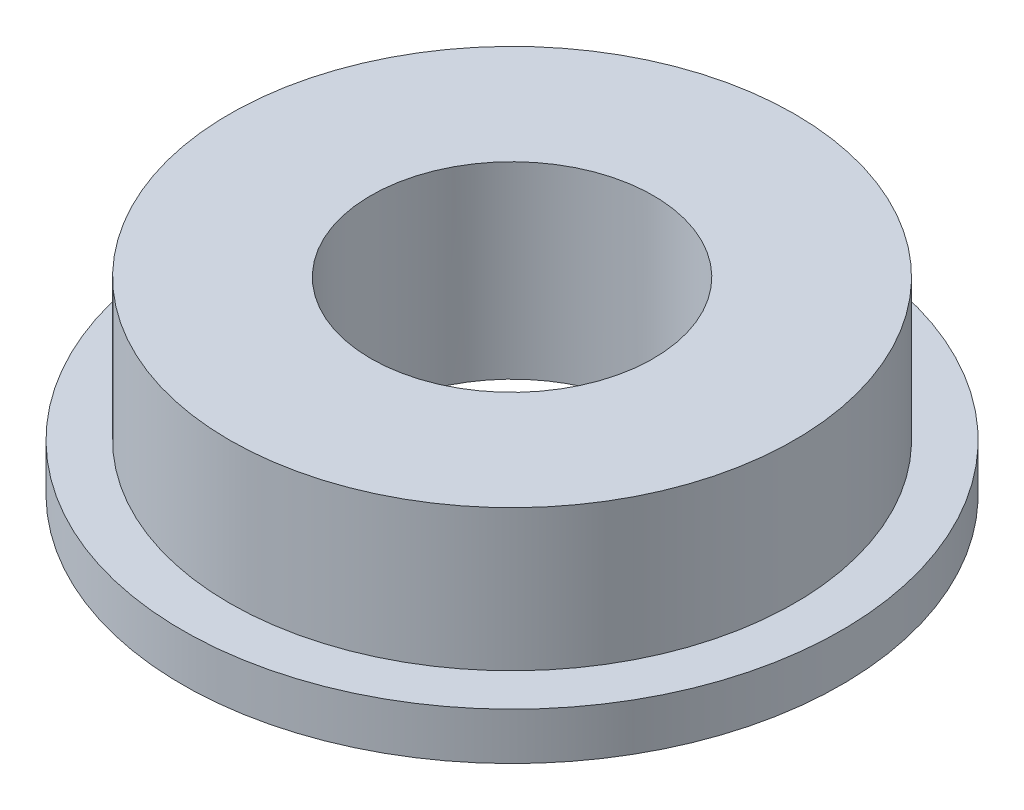
ISO-10303-21;
HEADER;
FILE_DESCRIPTION(('STEP AP214'),'2;1');
FILE_NAME('part.step','',(''),(''),'','','');
FILE_SCHEMA(('AUTOMOTIVE_DESIGN { 1 0 10303 214 1 1 1 1 }'));
ENDSEC;
DATA;
#1=APPLICATION_CONTEXT('core data for automotive mechanical design processes');
#2=APPLICATION_PROTOCOL_DEFINITION('international standard','automotive_design',2000,#1);
#3=PRODUCT_CONTEXT('',#1,'mechanical');
#4=PRODUCT('Part','Part','',(#3));
#5=PRODUCT_RELATED_PRODUCT_CATEGORY('part','',(#4));
#6=PRODUCT_DEFINITION_FORMATION('','',#4);
#7=PRODUCT_DEFINITION_CONTEXT('part definition',#1,'design');
#8=PRODUCT_DEFINITION('design','',#6,#7);
#9=PRODUCT_DEFINITION_SHAPE('','',#8);
#10=(LENGTH_UNIT() NAMED_UNIT(*) SI_UNIT(.MILLI.,.METRE.));
#11=(NAMED_UNIT(*) PLANE_ANGLE_UNIT() SI_UNIT($,.RADIAN.));
#12=(NAMED_UNIT(*) SI_UNIT($,.STERADIAN.) SOLID_ANGLE_UNIT());
#13=UNCERTAINTY_MEASURE_WITH_UNIT(LENGTH_MEASURE(1.E-05),#10,'distance_accuracy_value','');
#14=(GEOMETRIC_REPRESENTATION_CONTEXT(3) GLOBAL_UNCERTAINTY_ASSIGNED_CONTEXT((#13)) GLOBAL_UNIT_ASSIGNED_CONTEXT((#10,
#11,#12)) REPRESENTATION_CONTEXT('',''));
#15=CARTESIAN_POINT('',(0.,0.,0.));
#16=DIRECTION('',(0.,0.,1.));
#17=DIRECTION('',(1.,0.,0.));
#18=AXIS2_PLACEMENT_3D('',#15,#16,#17);
#19=CARTESIAN_POINT('',(0.,0.,0.));
#20=DIRECTION('',(0.,1.,0.));
#21=DIRECTION('',(0.,0.,1.));
#22=AXIS2_PLACEMENT_3D('',#19,#20,#21);
#23=PLANE('',#22);
#24=CARTESIAN_POINT('',(0.,0.,0.));
#25=DIRECTION('',(0.,1.,0.));
#26=DIRECTION('',(0.,0.,1.));
#27=AXIS2_PLACEMENT_3D('',#24,#25,#26);
#28=CIRCLE('',#27,3.);
#29=CARTESIAN_POINT('',(0.,0.,3.));
#30=VERTEX_POINT('',#29);
#31=EDGE_CURVE('E64',#30,#30,#28,.T.);
#32=ORIENTED_EDGE('',*,*,#31,.F.);
#33=EDGE_LOOP('',(#32));
#34=FACE_BOUND('',#33,.T.);
#35=CARTESIAN_POINT('',(0.,0.,0.));
#36=DIRECTION('',(0.,-1.,0.));
#37=DIRECTION('',(0.,0.,-1.));
#38=AXIS2_PLACEMENT_3D('',#35,#36,#37);
#39=CIRCLE('',#38,6.);
#40=CARTESIAN_POINT('',(0.,0.,-6.));
#41=VERTEX_POINT('',#40);
#42=EDGE_CURVE('E10',#41,#41,#39,.T.);
#43=ORIENTED_EDGE('',*,*,#42,.F.);
#44=EDGE_LOOP('',(#43));
#45=FACE_BOUND('',#44,.T.);
#46=ADVANCED_FACE('F37',(#34,#45),#23,.T.);
#47=CARTESIAN_POINT('',(0.,-4.,0.));
#48=DIRECTION('',(0.,-1.,0.));
#49=DIRECTION('',(0.,0.,-1.));
#50=AXIS2_PLACEMENT_3D('',#47,#48,#49);
#51=CYLINDRICAL_SURFACE('',#50,6.);
#52=ORIENTED_EDGE('',*,*,#42,.T.);
#53=EDGE_LOOP('',(#52));
#54=FACE_BOUND('',#53,.T.);
#55=CARTESIAN_POINT('',(0.,-3.,0.));
#56=DIRECTION('',(0.,-1.,0.));
#57=DIRECTION('',(0.,0.,-1.));
#58=AXIS2_PLACEMENT_3D('',#55,#56,#57);
#59=CIRCLE('',#58,6.);
#60=CARTESIAN_POINT('',(0.,-3.,-6.));
#61=VERTEX_POINT('',#60);
#62=EDGE_CURVE('E44',#61,#61,#59,.T.);
#63=ORIENTED_EDGE('',*,*,#62,.F.);
#64=EDGE_LOOP('',(#63));
#65=FACE_BOUND('',#64,.T.);
#66=ADVANCED_FACE('F74',(#54,#65),#51,.T.);
#67=CARTESIAN_POINT('',(6.,-3.,0.));
#68=DIRECTION('',(0.,1.,0.));
#69=DIRECTION('',(0.,0.,1.));
#70=AXIS2_PLACEMENT_3D('',#67,#68,#69);
#71=PLANE('',#70);
#72=ORIENTED_EDGE('',*,*,#62,.T.);
#73=EDGE_LOOP('',(#72));
#74=FACE_BOUND('',#73,.T.);
#75=CARTESIAN_POINT('',(0.,-3.,0.));
#76=DIRECTION('',(0.,-1.,0.));
#77=DIRECTION('',(0.,0.,-1.));
#78=AXIS2_PLACEMENT_3D('',#75,#76,#77);
#79=CIRCLE('',#78,7.);
#80=CARTESIAN_POINT('',(0.,-3.,-7.));
#81=VERTEX_POINT('',#80);
#82=EDGE_CURVE('E49',#81,#81,#79,.T.);
#83=ORIENTED_EDGE('',*,*,#82,.F.);
#84=EDGE_LOOP('',(#83));
#85=FACE_BOUND('',#84,.T.);
#86=ADVANCED_FACE('F78',(#74,#85),#71,.T.);
#87=CARTESIAN_POINT('',(0.,-4.,0.));
#88=DIRECTION('',(0.,-1.,0.));
#89=DIRECTION('',(0.,0.,-1.));
#90=AXIS2_PLACEMENT_3D('',#87,#88,#89);
#91=CYLINDRICAL_SURFACE('',#90,7.);
#92=ORIENTED_EDGE('',*,*,#82,.T.);
#93=EDGE_LOOP('',(#92));
#94=FACE_BOUND('',#93,.T.);
#95=CARTESIAN_POINT('',(0.,-4.,0.));
#96=DIRECTION('',(0.,-1.,0.));
#97=DIRECTION('',(0.,0.,-1.));
#98=AXIS2_PLACEMENT_3D('',#95,#96,#97);
#99=CIRCLE('',#98,7.);
#100=CARTESIAN_POINT('',(0.,-4.,-7.));
#101=VERTEX_POINT('',#100);
#102=EDGE_CURVE('E54',#101,#101,#99,.T.);
#103=ORIENTED_EDGE('',*,*,#102,.F.);
#104=EDGE_LOOP('',(#103));
#105=FACE_BOUND('',#104,.T.);
#106=ADVANCED_FACE('F82',(#94,#105),#91,.T.);
#107=CARTESIAN_POINT('',(7.,-4.,0.));
#108=DIRECTION('',(0.,-1.,0.));
#109=DIRECTION('',(0.,0.,-1.));
#110=AXIS2_PLACEMENT_3D('',#107,#108,#109);
#111=PLANE('',#110);
#112=CARTESIAN_POINT('',(0.,-4.,0.));
#113=DIRECTION('',(0.,-1.,0.));
#114=DIRECTION('',(0.,0.,-1.));
#115=AXIS2_PLACEMENT_3D('',#112,#113,#114);
#116=CIRCLE('',#115,3.);
#117=CARTESIAN_POINT('',(0.,-4.,-3.));
#118=VERTEX_POINT('',#117);
#119=EDGE_CURVE('E60',#118,#118,#116,.F.);
#120=ORIENTED_EDGE('',*,*,#119,.T.);
#121=EDGE_LOOP('',(#120));
#122=FACE_BOUND('',#121,.T.);
#123=ORIENTED_EDGE('',*,*,#102,.T.);
#124=EDGE_LOOP('',(#123));
#125=FACE_BOUND('',#124,.T.);
#126=ADVANCED_FACE('F88',(#122,#125),#111,.T.);
#127=CARTESIAN_POINT('',(0.,-12.4852813742386,0.));
#128=DIRECTION('',(0.,1.,0.));
#129=DIRECTION('',(0.,0.,1.));
#130=AXIS2_PLACEMENT_3D('',#127,#128,#129);
#131=CYLINDRICAL_SURFACE('',#130,3.);
#132=ORIENTED_EDGE('',*,*,#31,.T.);
#133=EDGE_LOOP('',(#132));
#134=FACE_BOUND('',#133,.T.);
#135=ORIENTED_EDGE('',*,*,#119,.F.);
#136=EDGE_LOOP('',(#135));
#137=FACE_BOUND('',#136,.T.);
#138=ADVANCED_FACE('F69',(#134,#137),#131,.F.);
#139=CLOSED_SHELL('',(#46,#66,#86,#106,#126,#138));
#140=MANIFOLD_SOLID_BREP('B2',#139);
#141=ADVANCED_BREP_SHAPE_REPRESENTATION('',(#18,#140),#14);
#142=SHAPE_DEFINITION_REPRESENTATION(#9,#141);
ENDSEC;
END-ISO-10303-21;
